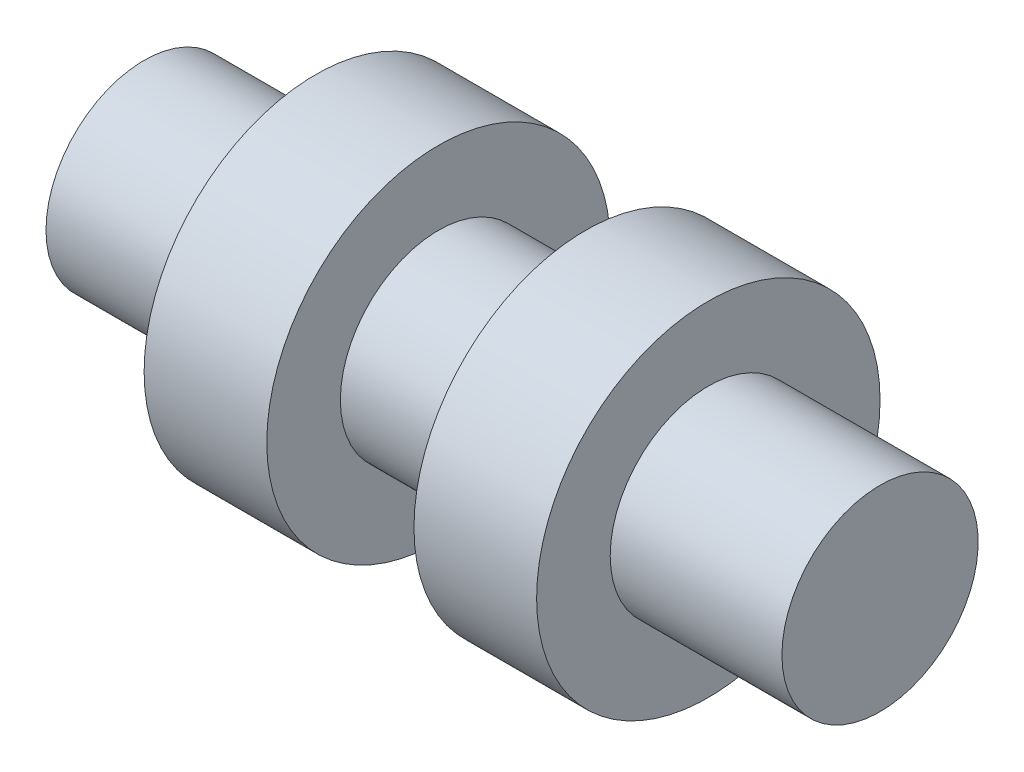
ISO-10303-21;
HEADER;
FILE_DESCRIPTION(('STEP AP214'),'2;1');
FILE_NAME('part.step','',(''),(''),'','','');
FILE_SCHEMA(('AUTOMOTIVE_DESIGN { 1 0 10303 214 1 1 1 1 }'));
ENDSEC;
DATA;
#1=APPLICATION_CONTEXT('core data for automotive mechanical design processes');
#2=APPLICATION_PROTOCOL_DEFINITION('international standard','automotive_design',2000,#1);
#3=PRODUCT_CONTEXT('',#1,'mechanical');
#4=PRODUCT('Part','Part','',(#3));
#5=PRODUCT_RELATED_PRODUCT_CATEGORY('part','',(#4));
#6=PRODUCT_DEFINITION_FORMATION('','',#4);
#7=PRODUCT_DEFINITION_CONTEXT('part definition',#1,'design');
#8=PRODUCT_DEFINITION('design','',#6,#7);
#9=PRODUCT_DEFINITION_SHAPE('','',#8);
#10=(LENGTH_UNIT() NAMED_UNIT(*) SI_UNIT(.MILLI.,.METRE.));
#11=(NAMED_UNIT(*) PLANE_ANGLE_UNIT() SI_UNIT($,.RADIAN.));
#12=(NAMED_UNIT(*) SI_UNIT($,.STERADIAN.) SOLID_ANGLE_UNIT());
#13=UNCERTAINTY_MEASURE_WITH_UNIT(LENGTH_MEASURE(1.E-05),#10,'distance_accuracy_value','');
#14=(GEOMETRIC_REPRESENTATION_CONTEXT(3) GLOBAL_UNCERTAINTY_ASSIGNED_CONTEXT((#13)) GLOBAL_UNIT_ASSIGNED_CONTEXT((#10,
#11,#12)) REPRESENTATION_CONTEXT('',''));
#15=CARTESIAN_POINT('',(0.,0.,0.));
#16=DIRECTION('',(0.,0.,1.));
#17=DIRECTION('',(1.,0.,0.));
#18=AXIS2_PLACEMENT_3D('',#15,#16,#17);
#19=CARTESIAN_POINT('',(75.,20.,0.));
#20=DIRECTION('',(-1.,0.,0.));
#21=DIRECTION('',(0.,0.,1.));
#22=AXIS2_PLACEMENT_3D('',#19,#20,#21);
#23=PLANE('',#22);
#24=CARTESIAN_POINT('',(75.,0.,0.));
#25=DIRECTION('',(-1.,0.,0.));
#26=DIRECTION('',(0.,0.,1.));
#27=AXIS2_PLACEMENT_3D('',#24,#25,#26);
#28=CIRCLE('',#27,20.);
#29=CARTESIAN_POINT('',(75.,0.,20.));
#30=VERTEX_POINT('',#29);
#31=EDGE_CURVE('E65',#30,#30,#28,.T.);
#32=ORIENTED_EDGE('',*,*,#31,.F.);
#33=EDGE_LOOP('',(#32));
#34=FACE_BOUND('',#33,.T.);
#35=ADVANCED_FACE('F31',(#34),#23,.F.);
#36=CARTESIAN_POINT('',(-75.,20.,0.));
#37=DIRECTION('',(1.,0.,0.));
#38=DIRECTION('',(0.,0.,-1.));
#39=AXIS2_PLACEMENT_3D('',#36,#37,#38);
#40=PLANE('',#39);
#41=CARTESIAN_POINT('',(-75.,0.,0.));
#42=DIRECTION('',(-1.,0.,0.));
#43=DIRECTION('',(0.,0.,1.));
#44=AXIS2_PLACEMENT_3D('',#41,#42,#43);
#45=CIRCLE('',#44,20.);
#46=CARTESIAN_POINT('',(-75.,0.,20.));
#47=VERTEX_POINT('',#46);
#48=EDGE_CURVE('E10',#47,#47,#45,.T.);
#49=ORIENTED_EDGE('',*,*,#48,.T.);
#50=EDGE_LOOP('',(#49));
#51=FACE_BOUND('',#50,.T.);
#52=ADVANCED_FACE('F72',(#51),#40,.F.);
#53=CARTESIAN_POINT('',(0.,0.,0.));
#54=DIRECTION('',(-1.,0.,0.));
#55=DIRECTION('',(0.,0.,1.));
#56=AXIS2_PLACEMENT_3D('',#53,#54,#55);
#57=CYLINDRICAL_SURFACE('',#56,20.);
#58=ORIENTED_EDGE('',*,*,#48,.F.);
#59=EDGE_LOOP('',(#58));
#60=FACE_BOUND('',#59,.T.);
#61=CARTESIAN_POINT('',(-40.,0.,0.));
#62=DIRECTION('',(-1.,0.,0.));
#63=DIRECTION('',(0.,0.,1.));
#64=AXIS2_PLACEMENT_3D('',#61,#62,#63);
#65=CIRCLE('',#64,20.);
#66=CARTESIAN_POINT('',(-40.,0.,20.));
#67=VERTEX_POINT('',#66);
#68=EDGE_CURVE('E37',#67,#67,#65,.T.);
#69=ORIENTED_EDGE('',*,*,#68,.T.);
#70=EDGE_LOOP('',(#69));
#71=FACE_BOUND('',#70,.T.);
#72=ADVANCED_FACE('F76',(#60,#71),#57,.T.);
#73=CARTESIAN_POINT('',(-40.,35.,0.));
#74=DIRECTION('',(1.,0.,0.));
#75=DIRECTION('',(0.,0.,-1.));
#76=AXIS2_PLACEMENT_3D('',#73,#74,#75);
#77=PLANE('',#76);
#78=ORIENTED_EDGE('',*,*,#68,.F.);
#79=EDGE_LOOP('',(#78));
#80=FACE_BOUND('',#79,.T.);
#81=CARTESIAN_POINT('',(-40.,0.,0.));
#82=DIRECTION('',(-1.,0.,0.));
#83=DIRECTION('',(0.,0.,1.));
#84=AXIS2_PLACEMENT_3D('',#81,#82,#83);
#85=CIRCLE('',#84,35.);
#86=CARTESIAN_POINT('',(-40.,0.,35.));
#87=VERTEX_POINT('',#86);
#88=EDGE_CURVE('E41',#87,#87,#85,.T.);
#89=ORIENTED_EDGE('',*,*,#88,.T.);
#90=EDGE_LOOP('',(#89));
#91=FACE_BOUND('',#90,.T.);
#92=ADVANCED_FACE('F80',(#80,#91),#77,.F.);
#93=CARTESIAN_POINT('',(0.,0.,0.));
#94=DIRECTION('',(-1.,0.,0.));
#95=DIRECTION('',(0.,0.,1.));
#96=AXIS2_PLACEMENT_3D('',#93,#94,#95);
#97=CYLINDRICAL_SURFACE('',#96,35.);
#98=ORIENTED_EDGE('',*,*,#88,.F.);
#99=EDGE_LOOP('',(#98));
#100=FACE_BOUND('',#99,.T.);
#101=CARTESIAN_POINT('',(-15.,0.,0.));
#102=DIRECTION('',(-1.,0.,0.));
#103=DIRECTION('',(0.,0.,1.));
#104=AXIS2_PLACEMENT_3D('',#101,#102,#103);
#105=CIRCLE('',#104,35.);
#106=CARTESIAN_POINT('',(-15.,0.,35.));
#107=VERTEX_POINT('',#106);
#108=EDGE_CURVE('E45',#107,#107,#105,.T.);
#109=ORIENTED_EDGE('',*,*,#108,.T.);
#110=EDGE_LOOP('',(#109));
#111=FACE_BOUND('',#110,.T.);
#112=ADVANCED_FACE('F86',(#100,#111),#97,.T.);
#113=CARTESIAN_POINT('',(-15.,20.,0.));
#114=DIRECTION('',(-1.,0.,0.));
#115=DIRECTION('',(0.,0.,1.));
#116=AXIS2_PLACEMENT_3D('',#113,#114,#115);
#117=PLANE('',#116);
#118=ORIENTED_EDGE('',*,*,#108,.F.);
#119=EDGE_LOOP('',(#118));
#120=FACE_BOUND('',#119,.T.);
#121=CARTESIAN_POINT('',(-15.,0.,0.));
#122=DIRECTION('',(-1.,0.,0.));
#123=DIRECTION('',(0.,0.,1.));
#124=AXIS2_PLACEMENT_3D('',#121,#122,#123);
#125=CIRCLE('',#124,20.);
#126=CARTESIAN_POINT('',(-15.,0.,20.));
#127=VERTEX_POINT('',#126);
#128=EDGE_CURVE('E50',#127,#127,#125,.T.);
#129=ORIENTED_EDGE('',*,*,#128,.T.);
#130=EDGE_LOOP('',(#129));
#131=FACE_BOUND('',#130,.T.);
#132=ADVANCED_FACE('F90',(#120,#131),#117,.F.);
#133=CARTESIAN_POINT('',(0.,0.,0.));
#134=DIRECTION('',(-1.,0.,0.));
#135=DIRECTION('',(0.,0.,1.));
#136=AXIS2_PLACEMENT_3D('',#133,#134,#135);
#137=CYLINDRICAL_SURFACE('',#136,20.);
#138=ORIENTED_EDGE('',*,*,#128,.F.);
#139=EDGE_LOOP('',(#138));
#140=FACE_BOUND('',#139,.T.);
#141=CARTESIAN_POINT('',(15.,0.,0.));
#142=DIRECTION('',(-1.,0.,0.));
#143=DIRECTION('',(0.,0.,1.));
#144=AXIS2_PLACEMENT_3D('',#141,#142,#143);
#145=CIRCLE('',#144,20.);
#146=CARTESIAN_POINT('',(15.,0.,20.));
#147=VERTEX_POINT('',#146);
#148=EDGE_CURVE('E53',#147,#147,#145,.T.);
#149=ORIENTED_EDGE('',*,*,#148,.T.);
#150=EDGE_LOOP('',(#149));
#151=FACE_BOUND('',#150,.T.);
#152=ADVANCED_FACE('F94',(#140,#151),#137,.T.);
#153=CARTESIAN_POINT('',(15.,20.,0.));
#154=DIRECTION('',(1.,0.,0.));
#155=DIRECTION('',(0.,0.,-1.));
#156=AXIS2_PLACEMENT_3D('',#153,#154,#155);
#157=PLANE('',#156);
#158=ORIENTED_EDGE('',*,*,#148,.F.);
#159=EDGE_LOOP('',(#158));
#160=FACE_BOUND('',#159,.T.);
#161=CARTESIAN_POINT('',(15.,0.,0.));
#162=DIRECTION('',(-1.,0.,0.));
#163=DIRECTION('',(0.,0.,1.));
#164=AXIS2_PLACEMENT_3D('',#161,#162,#163);
#165=CIRCLE('',#164,35.);
#166=CARTESIAN_POINT('',(15.,0.,35.));
#167=VERTEX_POINT('',#166);
#168=EDGE_CURVE('E56',#167,#167,#165,.T.);
#169=ORIENTED_EDGE('',*,*,#168,.T.);
#170=EDGE_LOOP('',(#169));
#171=FACE_BOUND('',#170,.T.);
#172=ADVANCED_FACE('F98',(#160,#171),#157,.F.);
#173=CARTESIAN_POINT('',(0.,0.,0.));
#174=DIRECTION('',(-1.,0.,0.));
#175=DIRECTION('',(0.,0.,1.));
#176=AXIS2_PLACEMENT_3D('',#173,#174,#175);
#177=CYLINDRICAL_SURFACE('',#176,35.);
#178=ORIENTED_EDGE('',*,*,#168,.F.);
#179=EDGE_LOOP('',(#178));
#180=FACE_BOUND('',#179,.T.);
#181=CARTESIAN_POINT('',(40.,0.,0.));
#182=DIRECTION('',(-1.,0.,0.));
#183=DIRECTION('',(0.,0.,1.));
#184=AXIS2_PLACEMENT_3D('',#181,#182,#183);
#185=CIRCLE('',#184,35.);
#186=CARTESIAN_POINT('',(40.,0.,35.));
#187=VERTEX_POINT('',#186);
#188=EDGE_CURVE('E59',#187,#187,#185,.T.);
#189=ORIENTED_EDGE('',*,*,#188,.T.);
#190=EDGE_LOOP('',(#189));
#191=FACE_BOUND('',#190,.T.);
#192=ADVANCED_FACE('F102',(#180,#191),#177,.T.);
#193=CARTESIAN_POINT('',(40.,35.,0.));
#194=DIRECTION('',(-1.,0.,0.));
#195=DIRECTION('',(0.,0.,1.));
#196=AXIS2_PLACEMENT_3D('',#193,#194,#195);
#197=PLANE('',#196);
#198=ORIENTED_EDGE('',*,*,#188,.F.);
#199=EDGE_LOOP('',(#198));
#200=FACE_BOUND('',#199,.T.);
#201=CARTESIAN_POINT('',(40.,0.,0.));
#202=DIRECTION('',(-1.,0.,0.));
#203=DIRECTION('',(0.,0.,1.));
#204=AXIS2_PLACEMENT_3D('',#201,#202,#203);
#205=CIRCLE('',#204,20.);
#206=CARTESIAN_POINT('',(40.,0.,20.));
#207=VERTEX_POINT('',#206);
#208=EDGE_CURVE('E62',#207,#207,#205,.T.);
#209=ORIENTED_EDGE('',*,*,#208,.T.);
#210=EDGE_LOOP('',(#209));
#211=FACE_BOUND('',#210,.T.);
#212=ADVANCED_FACE('F106',(#200,#211),#197,.F.);
#213=CARTESIAN_POINT('',(0.,0.,0.));
#214=DIRECTION('',(-1.,0.,0.));
#215=DIRECTION('',(0.,0.,1.));
#216=AXIS2_PLACEMENT_3D('',#213,#214,#215);
#217=CYLINDRICAL_SURFACE('',#216,20.);
#218=ORIENTED_EDGE('',*,*,#208,.F.);
#219=EDGE_LOOP('',(#218));
#220=FACE_BOUND('',#219,.T.);
#221=ORIENTED_EDGE('',*,*,#31,.T.);
#222=EDGE_LOOP('',(#221));
#223=FACE_BOUND('',#222,.T.);
#224=ADVANCED_FACE('F69',(#220,#223),#217,.T.);
#225=CLOSED_SHELL('',(#35,#52,#72,#92,#112,#132,#152,#172,#192,#212,#224));
#226=MANIFOLD_SOLID_BREP('B2',#225);
#227=ADVANCED_BREP_SHAPE_REPRESENTATION('',(#18,#226),#14);
#228=SHAPE_DEFINITION_REPRESENTATION(#9,#227);
ENDSEC;
END-ISO-10303-21;
